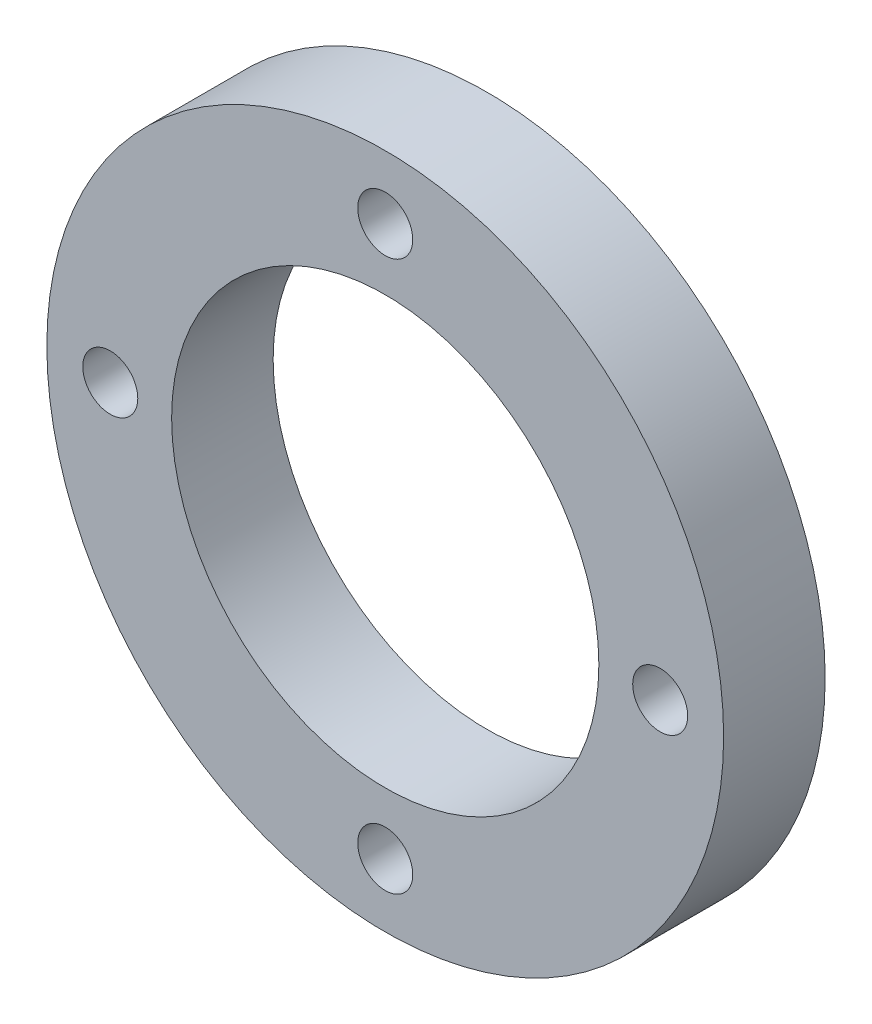
ISO-10303-21;
HEADER;
FILE_DESCRIPTION(('STEP AP214'),'2;1');
FILE_NAME('part.step','',(''),(''),'','','');
FILE_SCHEMA(('AUTOMOTIVE_DESIGN { 1 0 10303 214 1 1 1 1 }'));
ENDSEC;
DATA;
#1=APPLICATION_CONTEXT('core data for automotive mechanical design processes');
#2=APPLICATION_PROTOCOL_DEFINITION('international standard','automotive_design',2000,#1);
#3=PRODUCT_CONTEXT('',#1,'mechanical');
#4=PRODUCT('Part','Part','',(#3));
#5=PRODUCT_RELATED_PRODUCT_CATEGORY('part','',(#4));
#6=PRODUCT_DEFINITION_FORMATION('','',#4);
#7=PRODUCT_DEFINITION_CONTEXT('part definition',#1,'design');
#8=PRODUCT_DEFINITION('design','',#6,#7);
#9=PRODUCT_DEFINITION_SHAPE('','',#8);
#10=(LENGTH_UNIT() NAMED_UNIT(*) SI_UNIT(.MILLI.,.METRE.));
#11=(NAMED_UNIT(*) PLANE_ANGLE_UNIT() SI_UNIT($,.RADIAN.));
#12=(NAMED_UNIT(*) SI_UNIT($,.STERADIAN.) SOLID_ANGLE_UNIT());
#13=UNCERTAINTY_MEASURE_WITH_UNIT(LENGTH_MEASURE(1.E-05),#10,'distance_accuracy_value','');
#14=(GEOMETRIC_REPRESENTATION_CONTEXT(3) GLOBAL_UNCERTAINTY_ASSIGNED_CONTEXT((#13)) GLOBAL_UNIT_ASSIGNED_CONTEXT((#10,
#11,#12)) REPRESENTATION_CONTEXT('',''));
#15=CARTESIAN_POINT('',(0.,0.,0.));
#16=DIRECTION('',(0.,0.,1.));
#17=DIRECTION('',(1.,0.,0.));
#18=AXIS2_PLACEMENT_3D('',#15,#16,#17);
#19=CARTESIAN_POINT('',(0.,0.,6.));
#20=DIRECTION('',(0.,0.,1.));
#21=DIRECTION('',(1.,0.,0.));
#22=AXIS2_PLACEMENT_3D('',#19,#20,#21);
#23=PLANE('',#22);
#24=CARTESIAN_POINT('',(0.,-32.5,6.));
#25=DIRECTION('',(0.,0.,1.));
#26=DIRECTION('',(-1.,0.,0.));
#27=AXIS2_PLACEMENT_3D('',#24,#25,#26);
#28=CIRCLE('',#27,3.25);
#29=CARTESIAN_POINT('',(-3.24999999999999,-32.5,6.));
#30=VERTEX_POINT('',#29);
#31=EDGE_CURVE('E61',#30,#30,#28,.T.);
#32=ORIENTED_EDGE('',*,*,#31,.F.);
#33=EDGE_LOOP('',(#32));
#34=FACE_BOUND('',#33,.T.);
#35=CARTESIAN_POINT('',(-32.5,0.,6.));
#36=DIRECTION('',(0.,0.,1.));
#37=DIRECTION('',(1.,0.,0.));
#38=AXIS2_PLACEMENT_3D('',#35,#36,#37);
#39=CIRCLE('',#38,3.25);
#40=CARTESIAN_POINT('',(-29.25,0.,6.));
#41=VERTEX_POINT('',#40);
#42=EDGE_CURVE('E49',#41,#41,#39,.T.);
#43=ORIENTED_EDGE('',*,*,#42,.F.);
#44=EDGE_LOOP('',(#43));
#45=FACE_BOUND('',#44,.T.);
#46=CARTESIAN_POINT('',(0.,0.,6.));
#47=DIRECTION('',(0.,0.,1.));
#48=DIRECTION('',(1.,0.,0.));
#49=AXIS2_PLACEMENT_3D('',#46,#47,#48);
#50=CIRCLE('',#49,40.);
#51=CARTESIAN_POINT('',(40.,0.,6.));
#52=VERTEX_POINT('',#51);
#53=EDGE_CURVE('E10',#52,#52,#50,.T.);
#54=ORIENTED_EDGE('',*,*,#53,.T.);
#55=EDGE_LOOP('',(#54));
#56=FACE_BOUND('',#55,.T.);
#57=CARTESIAN_POINT('',(0.,0.,6.));
#58=DIRECTION('',(0.,0.,1.));
#59=DIRECTION('',(1.,0.,0.));
#60=AXIS2_PLACEMENT_3D('',#57,#58,#59);
#61=CIRCLE('',#60,25.25);
#62=CARTESIAN_POINT('',(25.25,0.,6.));
#63=VERTEX_POINT('',#62);
#64=EDGE_CURVE('E44',#63,#63,#61,.T.);
#65=ORIENTED_EDGE('',*,*,#64,.F.);
#66=EDGE_LOOP('',(#65));
#67=FACE_BOUND('',#66,.T.);
#68=CARTESIAN_POINT('',(0.,32.5,6.));
#69=DIRECTION('',(0.,0.,1.));
#70=DIRECTION('',(1.,0.,0.));
#71=AXIS2_PLACEMENT_3D('',#68,#69,#70);
#72=CIRCLE('',#71,3.25);
#73=CARTESIAN_POINT('',(3.25,32.5,6.));
#74=VERTEX_POINT('',#73);
#75=EDGE_CURVE('E55',#74,#74,#72,.T.);
#76=ORIENTED_EDGE('',*,*,#75,.F.);
#77=EDGE_LOOP('',(#76));
#78=FACE_BOUND('',#77,.T.);
#79=CARTESIAN_POINT('',(32.5,0.,6.));
#80=DIRECTION('',(0.,0.,1.));
#81=DIRECTION('',(-1.,0.,0.));
#82=AXIS2_PLACEMENT_3D('',#79,#80,#81);
#83=CIRCLE('',#82,3.25);
#84=CARTESIAN_POINT('',(29.25,0.,6.));
#85=VERTEX_POINT('',#84);
#86=EDGE_CURVE('E67',#85,#85,#83,.T.);
#87=ORIENTED_EDGE('',*,*,#86,.F.);
#88=EDGE_LOOP('',(#87));
#89=FACE_BOUND('',#88,.T.);
#90=ADVANCED_FACE('F33',(#34,#45,#56,#67,#78,#89),#23,.T.);
#91=CARTESIAN_POINT('',(0.,0.,-6.));
#92=DIRECTION('',(0.,0.,1.));
#93=DIRECTION('',(1.,0.,0.));
#94=AXIS2_PLACEMENT_3D('',#91,#92,#93);
#95=PLANE('',#94);
#96=CARTESIAN_POINT('',(0.,0.,-6.));
#97=DIRECTION('',(0.,0.,1.));
#98=DIRECTION('',(1.,0.,0.));
#99=AXIS2_PLACEMENT_3D('',#96,#97,#98);
#100=CIRCLE('',#99,40.);
#101=CARTESIAN_POINT('',(40.,0.,-6.));
#102=VERTEX_POINT('',#101);
#103=EDGE_CURVE('E37',#102,#102,#100,.T.);
#104=ORIENTED_EDGE('',*,*,#103,.F.);
#105=EDGE_LOOP('',(#104));
#106=FACE_BOUND('',#105,.T.);
#107=CARTESIAN_POINT('',(0.,0.,-6.));
#108=DIRECTION('',(0.,0.,1.));
#109=DIRECTION('',(1.,0.,0.));
#110=AXIS2_PLACEMENT_3D('',#107,#108,#109);
#111=CIRCLE('',#110,25.25);
#112=CARTESIAN_POINT('',(25.25,0.,-6.));
#113=VERTEX_POINT('',#112);
#114=EDGE_CURVE('E46',#113,#113,#111,.T.);
#115=ORIENTED_EDGE('',*,*,#114,.T.);
#116=EDGE_LOOP('',(#115));
#117=FACE_BOUND('',#116,.T.);
#118=CARTESIAN_POINT('',(-32.5,0.,-6.));
#119=DIRECTION('',(0.,0.,1.));
#120=DIRECTION('',(1.,0.,0.));
#121=AXIS2_PLACEMENT_3D('',#118,#119,#120);
#122=CIRCLE('',#121,3.25);
#123=CARTESIAN_POINT('',(-29.25,0.,-6.));
#124=VERTEX_POINT('',#123);
#125=EDGE_CURVE('E52',#124,#124,#122,.T.);
#126=ORIENTED_EDGE('',*,*,#125,.T.);
#127=EDGE_LOOP('',(#126));
#128=FACE_BOUND('',#127,.T.);
#129=CARTESIAN_POINT('',(0.,32.5,-6.));
#130=DIRECTION('',(0.,0.,1.));
#131=DIRECTION('',(1.,0.,0.));
#132=AXIS2_PLACEMENT_3D('',#129,#130,#131);
#133=CIRCLE('',#132,3.25);
#134=CARTESIAN_POINT('',(3.25,32.5,-6.));
#135=VERTEX_POINT('',#134);
#136=EDGE_CURVE('E58',#135,#135,#133,.T.);
#137=ORIENTED_EDGE('',*,*,#136,.T.);
#138=EDGE_LOOP('',(#137));
#139=FACE_BOUND('',#138,.T.);
#140=CARTESIAN_POINT('',(0.,-32.5,-6.));
#141=DIRECTION('',(0.,0.,1.));
#142=DIRECTION('',(-1.,0.,0.));
#143=AXIS2_PLACEMENT_3D('',#140,#141,#142);
#144=CIRCLE('',#143,3.25);
#145=CARTESIAN_POINT('',(-3.24999999999999,-32.5,-6.));
#146=VERTEX_POINT('',#145);
#147=EDGE_CURVE('E64',#146,#146,#144,.T.);
#148=ORIENTED_EDGE('',*,*,#147,.T.);
#149=EDGE_LOOP('',(#148));
#150=FACE_BOUND('',#149,.T.);
#151=CARTESIAN_POINT('',(32.5,0.,-6.));
#152=DIRECTION('',(0.,0.,1.));
#153=DIRECTION('',(-1.,0.,0.));
#154=AXIS2_PLACEMENT_3D('',#151,#152,#153);
#155=CIRCLE('',#154,3.25);
#156=CARTESIAN_POINT('',(29.25,0.,-6.));
#157=VERTEX_POINT('',#156);
#158=EDGE_CURVE('E70',#157,#157,#155,.T.);
#159=ORIENTED_EDGE('',*,*,#158,.T.);
#160=EDGE_LOOP('',(#159));
#161=FACE_BOUND('',#160,.T.);
#162=ADVANCED_FACE('F80',(#106,#117,#128,#139,#150,#161),#95,.F.);
#163=CARTESIAN_POINT('',(0.,0.,6.));
#164=DIRECTION('',(0.,0.,-1.));
#165=DIRECTION('',(-1.,0.,0.));
#166=AXIS2_PLACEMENT_3D('',#163,#164,#165);
#167=CYLINDRICAL_SURFACE('',#166,40.);
#168=ORIENTED_EDGE('',*,*,#53,.F.);
#169=EDGE_LOOP('',(#168));
#170=FACE_BOUND('',#169,.T.);
#171=ORIENTED_EDGE('',*,*,#103,.T.);
#172=EDGE_LOOP('',(#171));
#173=FACE_BOUND('',#172,.T.);
#174=ADVANCED_FACE('F35',(#170,#173),#167,.T.);
#175=CARTESIAN_POINT('',(0.,0.,6.));
#176=DIRECTION('',(0.,0.,-1.));
#177=DIRECTION('',(-1.,0.,0.));
#178=AXIS2_PLACEMENT_3D('',#175,#176,#177);
#179=CYLINDRICAL_SURFACE('',#178,25.25);
#180=ORIENTED_EDGE('',*,*,#64,.T.);
#181=EDGE_LOOP('',(#180));
#182=FACE_BOUND('',#181,.T.);
#183=ORIENTED_EDGE('',*,*,#114,.F.);
#184=EDGE_LOOP('',(#183));
#185=FACE_BOUND('',#184,.T.);
#186=ADVANCED_FACE('F90',(#182,#185),#179,.F.);
#187=CARTESIAN_POINT('',(-32.5,0.,6.));
#188=DIRECTION('',(0.,0.,-1.));
#189=DIRECTION('',(-1.,0.,0.));
#190=AXIS2_PLACEMENT_3D('',#187,#188,#189);
#191=CYLINDRICAL_SURFACE('',#190,3.25);
#192=ORIENTED_EDGE('',*,*,#42,.T.);
#193=EDGE_LOOP('',(#192));
#194=FACE_BOUND('',#193,.T.);
#195=ORIENTED_EDGE('',*,*,#125,.F.);
#196=EDGE_LOOP('',(#195));
#197=FACE_BOUND('',#196,.T.);
#198=ADVANCED_FACE('F93',(#194,#197),#191,.F.);
#199=CARTESIAN_POINT('',(0.,32.5,6.));
#200=DIRECTION('',(0.,0.,-1.));
#201=DIRECTION('',(-1.,0.,0.));
#202=AXIS2_PLACEMENT_3D('',#199,#200,#201);
#203=CYLINDRICAL_SURFACE('',#202,3.25);
#204=ORIENTED_EDGE('',*,*,#75,.T.);
#205=EDGE_LOOP('',(#204));
#206=FACE_BOUND('',#205,.T.);
#207=ORIENTED_EDGE('',*,*,#136,.F.);
#208=EDGE_LOOP('',(#207));
#209=FACE_BOUND('',#208,.T.);
#210=ADVANCED_FACE('F97',(#206,#209),#203,.F.);
#211=CARTESIAN_POINT('',(0.,-32.5,6.));
#212=DIRECTION('',(0.,0.,-1.));
#213=DIRECTION('',(-1.,0.,0.));
#214=AXIS2_PLACEMENT_3D('',#211,#212,#213);
#215=CYLINDRICAL_SURFACE('',#214,3.25);
#216=ORIENTED_EDGE('',*,*,#31,.T.);
#217=EDGE_LOOP('',(#216));
#218=FACE_BOUND('',#217,.T.);
#219=ORIENTED_EDGE('',*,*,#147,.F.);
#220=EDGE_LOOP('',(#219));
#221=FACE_BOUND('',#220,.T.);
#222=ADVANCED_FACE('F101',(#218,#221),#215,.F.);
#223=CARTESIAN_POINT('',(32.5,0.,6.));
#224=DIRECTION('',(0.,0.,-1.));
#225=DIRECTION('',(-1.,0.,0.));
#226=AXIS2_PLACEMENT_3D('',#223,#224,#225);
#227=CYLINDRICAL_SURFACE('',#226,3.25);
#228=ORIENTED_EDGE('',*,*,#86,.T.);
#229=EDGE_LOOP('',(#228));
#230=FACE_BOUND('',#229,.T.);
#231=ORIENTED_EDGE('',*,*,#158,.F.);
#232=EDGE_LOOP('',(#231));
#233=FACE_BOUND('',#232,.T.);
#234=ADVANCED_FACE('F76',(#230,#233),#227,.F.);
#235=CLOSED_SHELL('',(#90,#162,#174,#186,#198,#210,#222,#234));
#236=MANIFOLD_SOLID_BREP('B2',#235);
#237=ADVANCED_BREP_SHAPE_REPRESENTATION('',(#18,#236),#14);
#238=SHAPE_DEFINITION_REPRESENTATION(#9,#237);
ENDSEC;
END-ISO-10303-21;
